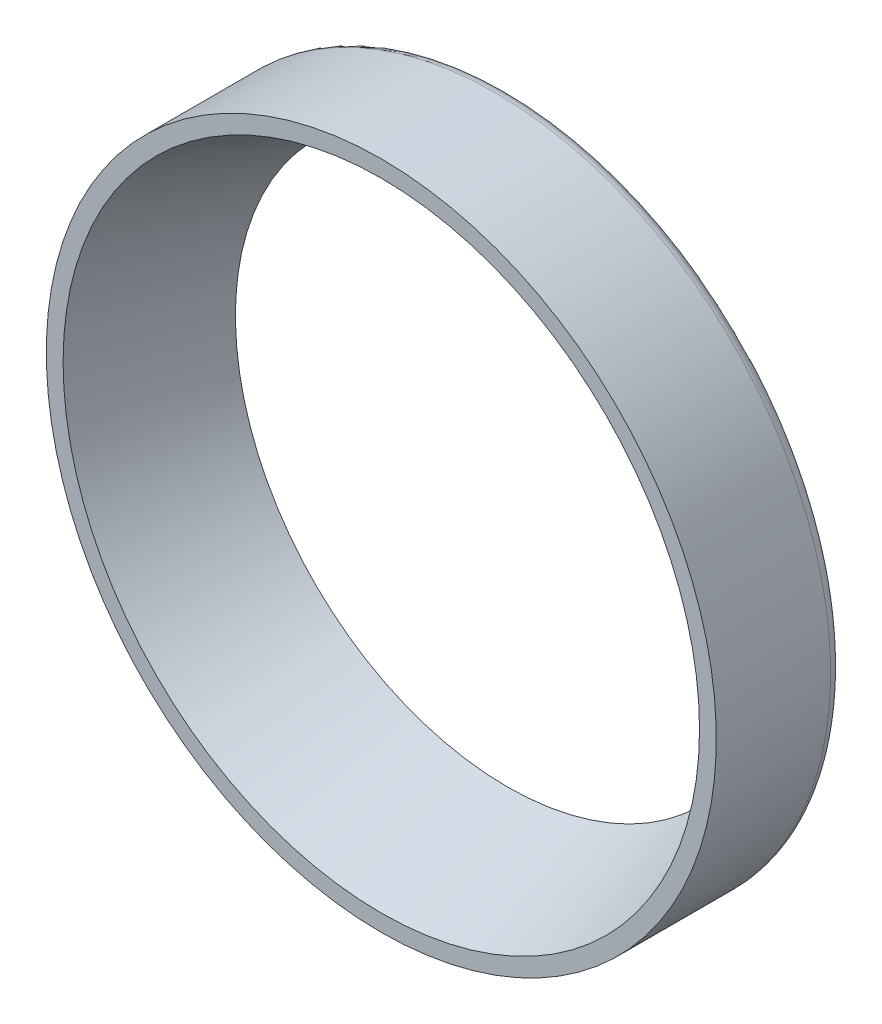
ISO-10303-21;
HEADER;
FILE_DESCRIPTION(('STEP AP214'),'2;1');
FILE_NAME('part.step','',(''),(''),'','','');
FILE_SCHEMA(('AUTOMOTIVE_DESIGN { 1 0 10303 214 1 1 1 1 }'));
ENDSEC;
DATA;
#1=APPLICATION_CONTEXT('core data for automotive mechanical design processes');
#2=APPLICATION_PROTOCOL_DEFINITION('international standard','automotive_design',2000,#1);
#3=PRODUCT_CONTEXT('',#1,'mechanical');
#4=PRODUCT('Part','Part','',(#3));
#5=PRODUCT_RELATED_PRODUCT_CATEGORY('part','',(#4));
#6=PRODUCT_DEFINITION_FORMATION('','',#4);
#7=PRODUCT_DEFINITION_CONTEXT('part definition',#1,'design');
#8=PRODUCT_DEFINITION('design','',#6,#7);
#9=PRODUCT_DEFINITION_SHAPE('','',#8);
#10=(LENGTH_UNIT() NAMED_UNIT(*) SI_UNIT(.MILLI.,.METRE.));
#11=(NAMED_UNIT(*) PLANE_ANGLE_UNIT() SI_UNIT($,.RADIAN.));
#12=(NAMED_UNIT(*) SI_UNIT($,.STERADIAN.) SOLID_ANGLE_UNIT());
#13=UNCERTAINTY_MEASURE_WITH_UNIT(LENGTH_MEASURE(1.E-05),#10,'distance_accuracy_value','');
#14=(GEOMETRIC_REPRESENTATION_CONTEXT(3) GLOBAL_UNCERTAINTY_ASSIGNED_CONTEXT((#13)) GLOBAL_UNIT_ASSIGNED_CONTEXT((#10,
#11,#12)) REPRESENTATION_CONTEXT('',''));
#15=CARTESIAN_POINT('',(0.,0.,0.));
#16=DIRECTION('',(0.,0.,1.));
#17=DIRECTION('',(1.,0.,0.));
#18=AXIS2_PLACEMENT_3D('',#15,#16,#17);
#19=CARTESIAN_POINT('',(0.,1.38777878078145E-13,11.7888688395686));
#20=DIRECTION('',(0.,0.,1.));
#21=DIRECTION('',(0.,-1.,0.));
#22=AXIS2_PLACEMENT_3D('',#19,#20,#21);
#23=CONICAL_SURFACE('',#22,38.8282862722768,0.350968259283539);
#24=CARTESIAN_POINT('',(0.,1.38777878078145E-13,16.));
#25=DIRECTION('',(0.,0.,-1.));
#26=DIRECTION('',(0.,-1.,0.));
#27=AXIS2_PLACEMENT_3D('',#24,#25,#26);
#28=CIRCLE('',#27,40.3700915486807);
#29=CARTESIAN_POINT('',(0.,-40.3700915486806,16.));
#30=VERTEX_POINT('',#29);
#31=EDGE_CURVE('E11',#30,#30,#28,.T.);
#32=ORIENTED_EDGE('',*,*,#31,.F.);
#33=EDGE_LOOP('',(#32));
#34=FACE_BOUND('',#33,.T.);
#35=CARTESIAN_POINT('',(0.,1.38777878078145E-13,0.));
#36=DIRECTION('',(0.,0.,-1.));
#37=DIRECTION('',(0.,-1.,0.));
#38=AXIS2_PLACEMENT_3D('',#35,#36,#37);
#39=CIRCLE('',#38,34.5120730062384);
#40=CARTESIAN_POINT('',(0.,-34.5120730062383,0.));
#41=VERTEX_POINT('',#40);
#42=EDGE_CURVE('E28',#41,#41,#39,.T.);
#43=ORIENTED_EDGE('',*,*,#42,.T.);
#44=EDGE_LOOP('',(#43));
#45=FACE_BOUND('',#44,.T.);
#46=ADVANCED_FACE('F17',(#34,#45),#23,.F.);
#47=CARTESIAN_POINT('',(0.,-41.4350457743402,16.));
#48=DIRECTION('',(0.,0.,1.));
#49=DIRECTION('',(1.,0.,0.));
#50=AXIS2_PLACEMENT_3D('',#47,#48,#49);
#51=PLANE('',#50);
#52=ORIENTED_EDGE('',*,*,#31,.T.);
#53=EDGE_LOOP('',(#52));
#54=FACE_BOUND('',#53,.T.);
#55=CARTESIAN_POINT('',(0.,1.38777878078145E-13,16.));
#56=DIRECTION('',(0.,0.,-1.));
#57=DIRECTION('',(0.,-1.,0.));
#58=AXIS2_PLACEMENT_3D('',#55,#56,#57);
#59=CIRCLE('',#58,42.5);
#60=CARTESIAN_POINT('',(0.,-42.5,16.));
#61=VERTEX_POINT('',#60);
#62=EDGE_CURVE('E61',#61,#61,#59,.T.);
#63=ORIENTED_EDGE('',*,*,#62,.F.);
#64=EDGE_LOOP('',(#63));
#65=FACE_BOUND('',#64,.T.);
#66=ADVANCED_FACE('F75',(#54,#65),#51,.T.);
#67=CARTESIAN_POINT('',(0.,-38.506036503119,0.));
#68=DIRECTION('',(0.,0.,-1.));
#69=DIRECTION('',(0.,-1.,0.));
#70=AXIS2_PLACEMENT_3D('',#67,#68,#69);
#71=PLANE('',#70);
#72=ORIENTED_EDGE('',*,*,#42,.F.);
#73=EDGE_LOOP('',(#72));
#74=FACE_BOUND('',#73,.T.);
#75=CARTESIAN_POINT('',(0.,1.38777878078145E-13,0.));
#76=DIRECTION('',(0.,0.,1.));
#77=DIRECTION('',(0.,1.,0.));
#78=AXIS2_PLACEMENT_3D('',#75,#76,#77);
#79=CIRCLE('',#78,41.);
#80=CARTESIAN_POINT('',(0.,41.,0.));
#81=VERTEX_POINT('',#80);
#82=EDGE_CURVE('E21',#81,#81,#79,.T.);
#83=ORIENTED_EDGE('',*,*,#82,.F.);
#84=EDGE_LOOP('',(#83));
#85=FACE_BOUND('',#84,.T.);
#86=ADVANCED_FACE('F19',(#74,#85),#71,.T.);
#87=CARTESIAN_POINT('',(0.,1.38777878078145E-13,8.));
#88=DIRECTION('',(0.,0.,-1.));
#89=DIRECTION('',(0.,-1.,0.));
#90=AXIS2_PLACEMENT_3D('',#87,#88,#89);
#91=CYLINDRICAL_SURFACE('',#90,42.5);
#92=ORIENTED_EDGE('',*,*,#62,.T.);
#93=EDGE_LOOP('',(#92));
#94=FACE_BOUND('',#93,.T.);
#95=CARTESIAN_POINT('',(0.,1.38777878078145E-13,1.5));
#96=DIRECTION('',(0.,0.,-1.));
#97=DIRECTION('',(0.,1.,0.));
#98=AXIS2_PLACEMENT_3D('',#95,#96,#97);
#99=CIRCLE('',#98,42.5);
#100=CARTESIAN_POINT('',(0.,42.5,1.5));
#101=VERTEX_POINT('',#100);
#102=EDGE_CURVE('E57',#101,#101,#99,.T.);
#103=ORIENTED_EDGE('',*,*,#102,.F.);
#104=EDGE_LOOP('',(#103));
#105=FACE_BOUND('',#104,.T.);
#106=ADVANCED_FACE('F74',(#94,#105),#91,.T.);
#107=CARTESIAN_POINT('',(0.,1.38777878078145E-13,1.5));
#108=DIRECTION('',(0.,0.,-1.));
#109=DIRECTION('',(1.,0.,0.));
#110=AXIS2_PLACEMENT_3D('',#107,#108,#109);
#111=TOROIDAL_SURFACE('',#110,41.,1.5);
#112=ORIENTED_EDGE('',*,*,#102,.T.);
#113=EDGE_LOOP('',(#112));
#114=FACE_BOUND('',#113,.T.);
#115=ORIENTED_EDGE('',*,*,#82,.T.);
#116=EDGE_LOOP('',(#115));
#117=FACE_BOUND('',#116,.T.);
#118=ADVANCED_FACE('F58',(#114,#117),#111,.T.);
#119=CLOSED_SHELL('',(#46,#66,#86,#106,#118));
#120=MANIFOLD_SOLID_BREP('B1',#119);
#121=ADVANCED_BREP_SHAPE_REPRESENTATION('',(#18,#120),#14);
#122=SHAPE_DEFINITION_REPRESENTATION(#9,#121);
ENDSEC;
END-ISO-10303-21;
